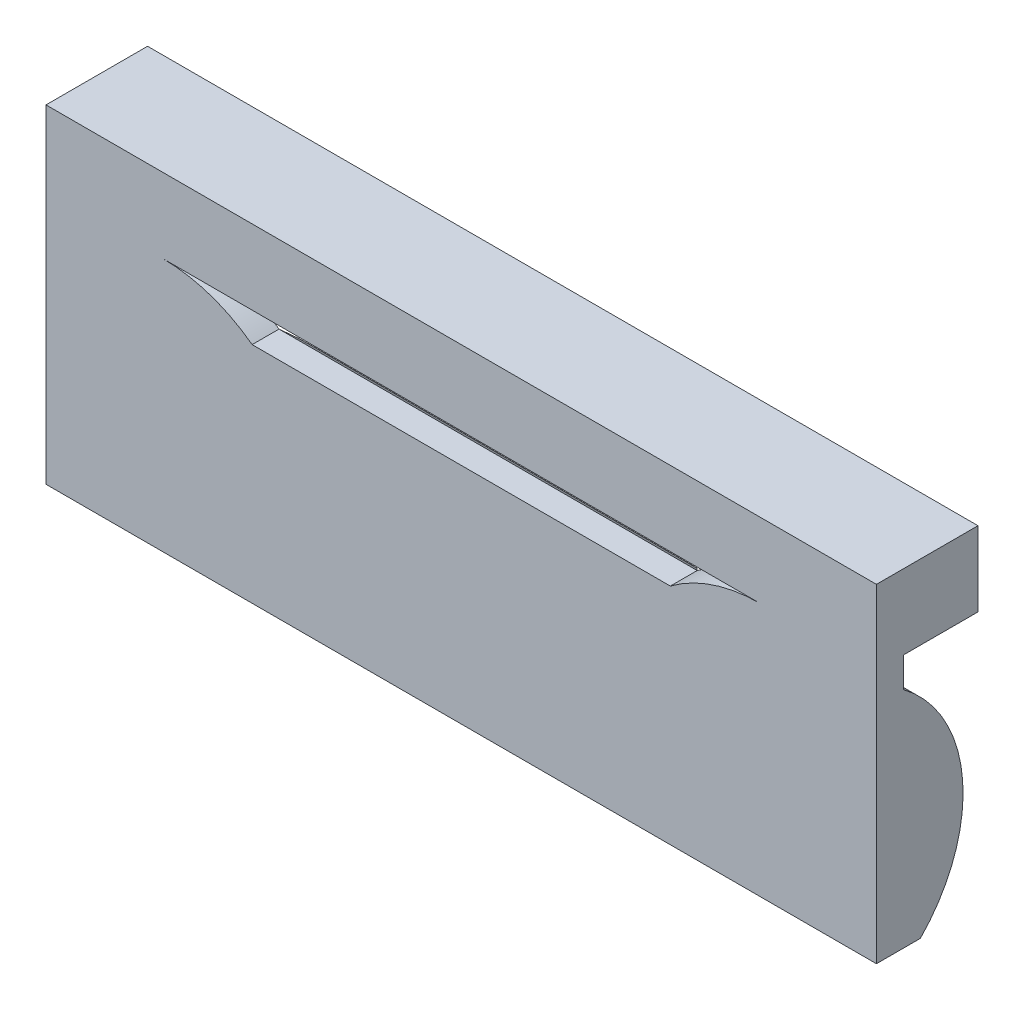
ISO-10303-21;
HEADER;
FILE_DESCRIPTION(('STEP AP214'),'2;1');
FILE_NAME('part.step','',(''),(''),'','','');
FILE_SCHEMA(('AUTOMOTIVE_DESIGN { 1 0 10303 214 1 1 1 1 }'));
ENDSEC;
DATA;
#1=APPLICATION_CONTEXT('core data for automotive mechanical design processes');
#2=APPLICATION_PROTOCOL_DEFINITION('international standard','automotive_design',2000,#1);
#3=PRODUCT_CONTEXT('',#1,'mechanical');
#4=PRODUCT('Part','Part','',(#3));
#5=PRODUCT_RELATED_PRODUCT_CATEGORY('part','',(#4));
#6=PRODUCT_DEFINITION_FORMATION('','',#4);
#7=PRODUCT_DEFINITION_CONTEXT('part definition',#1,'design');
#8=PRODUCT_DEFINITION('design','',#6,#7);
#9=PRODUCT_DEFINITION_SHAPE('','',#8);
#10=(LENGTH_UNIT() NAMED_UNIT(*) SI_UNIT(.MILLI.,.METRE.));
#11=(NAMED_UNIT(*) PLANE_ANGLE_UNIT() SI_UNIT($,.RADIAN.));
#12=(NAMED_UNIT(*) SI_UNIT($,.STERADIAN.) SOLID_ANGLE_UNIT());
#13=UNCERTAINTY_MEASURE_WITH_UNIT(LENGTH_MEASURE(1.E-05),#10,'distance_accuracy_value','');
#14=(GEOMETRIC_REPRESENTATION_CONTEXT(3) GLOBAL_UNCERTAINTY_ASSIGNED_CONTEXT((#13)) GLOBAL_UNIT_ASSIGNED_CONTEXT((#10,
#11,#12)) REPRESENTATION_CONTEXT('',''));
#15=CARTESIAN_POINT('',(0.,0.,0.));
#16=DIRECTION('',(0.,0.,1.));
#17=DIRECTION('',(1.,0.,0.));
#18=AXIS2_PLACEMENT_3D('',#15,#16,#17);
#19=CARTESIAN_POINT('',(6.5,0.,-1.475));
#20=DIRECTION('',(-1.,0.,0.));
#21=DIRECTION('',(0.,0.,1.));
#22=AXIS2_PLACEMENT_3D('',#19,#20,#21);
#23=PLANE('',#22);
#24=CARTESIAN_POINT('',(6.5,-0.999999999999999,1.275));
#25=DIRECTION('',(-1.,0.,0.));
#26=DIRECTION('',(0.,0.,1.));
#27=AXIS2_PLACEMENT_3D('',#24,#25,#26);
#28=CIRCLE('',#27,2.5);
#29=CARTESIAN_POINT('',(6.5,-2.25,-0.890063509461097));
#30=VERTEX_POINT('',#29);
#31=CARTESIAN_POINT('',(6.5,1.,-0.225));
#32=VERTEX_POINT('',#31);
#33=EDGE_CURVE('E191',#30,#32,#28,.F.);
#34=ORIENTED_EDGE('',*,*,#33,.F.);
#35=DIRECTION('',(0.,0.,1.));
#36=VECTOR('',#35,1.);
#37=CARTESIAN_POINT('',(6.5,-2.25,-1.475));
#38=LINE('',#37,#36);
#39=CARTESIAN_POINT('',(6.5,-2.25,-0.225));
#40=VERTEX_POINT('',#39);
#41=EDGE_CURVE('E341',#30,#40,#38,.T.);
#42=ORIENTED_EDGE('',*,*,#41,.T.);
#43=DIRECTION('',(0.,-1.,0.));
#44=VECTOR('',#43,1.);
#45=CARTESIAN_POINT('',(6.5,0.,-0.225));
#46=LINE('',#45,#44);
#47=EDGE_CURVE('E317',#32,#40,#46,.T.);
#48=ORIENTED_EDGE('',*,*,#47,.F.);
#49=EDGE_LOOP('',(#34,#42,#48));
#50=FACE_BOUND('',#49,.T.);
#51=ADVANCED_FACE('F43',(#50),#23,.T.);
#52=CARTESIAN_POINT('',(-6.5,0.,-1.475));
#53=DIRECTION('',(1.,0.,0.));
#54=DIRECTION('',(0.,1.,0.));
#55=AXIS2_PLACEMENT_3D('',#52,#53,#54);
#56=PLANE('',#55);
#57=CARTESIAN_POINT('',(-6.5,-0.999999999999999,1.275));
#58=DIRECTION('',(1.,0.,0.));
#59=DIRECTION('',(0.,1.,0.));
#60=AXIS2_PLACEMENT_3D('',#57,#58,#59);
#61=CIRCLE('',#60,2.5);
#62=CARTESIAN_POINT('',(-6.5,1.,-0.225));
#63=VERTEX_POINT('',#62);
#64=CARTESIAN_POINT('',(-6.5,-2.25,-0.890063509461097));
#65=VERTEX_POINT('',#64);
#66=EDGE_CURVE('E248',#63,#65,#61,.F.);
#67=ORIENTED_EDGE('',*,*,#66,.F.);
#68=DIRECTION('',(0.,1.,0.));
#69=VECTOR('',#68,1.);
#70=CARTESIAN_POINT('',(-6.5,0.,-0.225));
#71=LINE('',#70,#69);
#72=CARTESIAN_POINT('',(-6.5,-2.25,-0.225));
#73=VERTEX_POINT('',#72);
#74=EDGE_CURVE('E350',#73,#63,#71,.T.);
#75=ORIENTED_EDGE('',*,*,#74,.F.);
#76=DIRECTION('',(0.,0.,1.));
#77=VECTOR('',#76,1.);
#78=CARTESIAN_POINT('',(-6.5,-2.25,-1.475));
#79=LINE('',#78,#77);
#80=EDGE_CURVE('E67',#65,#73,#79,.T.);
#81=ORIENTED_EDGE('',*,*,#80,.F.);
#82=EDGE_LOOP('',(#67,#75,#81));
#83=FACE_BOUND('',#82,.T.);
#84=ADVANCED_FACE('F451',(#83),#56,.T.);
#85=CARTESIAN_POINT('',(0.,0.,-1.475));
#86=DIRECTION('',(0.,0.,-1.));
#87=DIRECTION('',(-1.,0.,0.));
#88=AXIS2_PLACEMENT_3D('',#85,#86,#87);
#89=PLANE('',#88);
#90=DIRECTION('',(0.,-1.,0.));
#91=VECTOR('',#90,1.);
#92=CARTESIAN_POINT('',(6.95,0.,-1.475));
#93=LINE('',#92,#91);
#94=CARTESIAN_POINT('',(6.95,2.75,-1.475));
#95=VERTEX_POINT('',#94);
#96=CARTESIAN_POINT('',(6.95,1.5,-1.475));
#97=VERTEX_POINT('',#96);
#98=EDGE_CURVE('E334',#95,#97,#93,.T.);
#99=ORIENTED_EDGE('',*,*,#98,.T.);
#100=DIRECTION('',(-1.,0.,0.));
#101=VECTOR('',#100,1.);
#102=CARTESIAN_POINT('',(0.,1.5,-1.475));
#103=LINE('',#102,#101);
#104=CARTESIAN_POINT('',(6.5,1.5,-1.475));
#105=VERTEX_POINT('',#104);
#106=EDGE_CURVE('E259',#97,#105,#103,.T.);
#107=ORIENTED_EDGE('',*,*,#106,.T.);
#108=DIRECTION('',(0.,-1.,0.));
#109=VECTOR('',#108,1.);
#110=CARTESIAN_POINT('',(6.5,0.,-1.475));
#111=LINE('',#110,#109);
#112=CARTESIAN_POINT('',(6.5,2.25,-1.475));
#113=VERTEX_POINT('',#112);
#114=EDGE_CURVE('E318',#113,#105,#111,.T.);
#115=ORIENTED_EDGE('',*,*,#114,.F.);
#116=DIRECTION('',(1.,0.,0.));
#117=VECTOR('',#116,1.);
#118=CARTESIAN_POINT('',(0.,2.25,-1.475));
#119=LINE('',#118,#117);
#120=CARTESIAN_POINT('',(-6.5,2.25,-1.475));
#121=VERTEX_POINT('',#120);
#122=EDGE_CURVE('E322',#121,#113,#119,.T.);
#123=ORIENTED_EDGE('',*,*,#122,.F.);
#124=DIRECTION('',(0.,1.,0.));
#125=VECTOR('',#124,1.);
#126=CARTESIAN_POINT('',(-6.5,0.,-1.475));
#127=LINE('',#126,#125);
#128=CARTESIAN_POINT('',(-6.5,1.5,-1.475));
#129=VERTEX_POINT('',#128);
#130=EDGE_CURVE('E327',#129,#121,#127,.T.);
#131=ORIENTED_EDGE('',*,*,#130,.F.);
#132=CARTESIAN_POINT('',(-6.95,1.5,-1.475));
#133=VERTEX_POINT('',#132);
#134=EDGE_CURVE('E254',#129,#133,#103,.T.);
#135=ORIENTED_EDGE('',*,*,#134,.T.);
#136=DIRECTION('',(0.,1.,0.));
#137=VECTOR('',#136,1.);
#138=CARTESIAN_POINT('',(-6.95,0.,-1.475));
#139=LINE('',#138,#137);
#140=CARTESIAN_POINT('',(-6.95,2.74999999999995,-1.475));
#141=VERTEX_POINT('',#140);
#142=EDGE_CURVE('E338',#133,#141,#139,.T.);
#143=ORIENTED_EDGE('',*,*,#142,.T.);
#144=DIRECTION('',(1.,0.,0.));
#145=VECTOR('',#144,1.);
#146=CARTESIAN_POINT('',(0.,2.74999999999997,-1.475));
#147=LINE('',#146,#145);
#148=EDGE_CURVE('E330',#141,#95,#147,.T.);
#149=ORIENTED_EDGE('',*,*,#148,.T.);
#150=EDGE_LOOP('',(#99,#107,#115,#123,#131,#135,#143,#149));
#151=FACE_BOUND('',#150,.T.);
#152=ADVANCED_FACE('F401',(#151),#89,.T.);
#153=CARTESIAN_POINT('',(0.,0.,0.225));
#154=DIRECTION('',(0.,0.,1.));
#155=DIRECTION('',(1.,0.,0.));
#156=AXIS2_PLACEMENT_3D('',#153,#154,#155);
#157=PLANE('',#156);
#158=DIRECTION('',(0.,1.,0.));
#159=VECTOR('',#158,1.);
#160=CARTESIAN_POINT('',(6.95,0.,0.225));
#161=LINE('',#160,#159);
#162=CARTESIAN_POINT('',(6.95,-2.75,0.225));
#163=VERTEX_POINT('',#162);
#164=CARTESIAN_POINT('',(6.95,2.75,0.225));
#165=VERTEX_POINT('',#164);
#166=EDGE_CURVE('E369',#163,#165,#161,.T.);
#167=ORIENTED_EDGE('',*,*,#166,.T.);
#168=DIRECTION('',(-1.,0.,0.));
#169=VECTOR('',#168,1.);
#170=CARTESIAN_POINT('',(0.,2.74999999999997,0.225));
#171=LINE('',#170,#169);
#172=CARTESIAN_POINT('',(-6.95,2.75,0.225));
#173=VERTEX_POINT('',#172);
#174=EDGE_CURVE('E373',#165,#173,#171,.T.);
#175=ORIENTED_EDGE('',*,*,#174,.T.);
#176=DIRECTION('',(0.,1.,0.));
#177=VECTOR('',#176,1.);
#178=CARTESIAN_POINT('',(-6.95,0.,0.225));
#179=LINE('',#178,#177);
#180=CARTESIAN_POINT('',(-6.95,-2.75,0.225));
#181=VERTEX_POINT('',#180);
#182=EDGE_CURVE('E376',#181,#173,#179,.T.);
#183=ORIENTED_EDGE('',*,*,#182,.F.);
#184=DIRECTION('',(1.,0.,0.));
#185=VECTOR('',#184,1.);
#186=CARTESIAN_POINT('',(0.,-2.75,0.225));
#187=LINE('',#186,#185);
#188=EDGE_CURVE('E380',#181,#163,#187,.T.);
#189=ORIENTED_EDGE('',*,*,#188,.T.);
#190=EDGE_LOOP('',(#167,#175,#183,#189));
#191=FACE_BOUND('',#190,.T.);
#192=DIRECTION('',(1.,0.,0.));
#193=VECTOR('',#192,1.);
#194=CARTESIAN_POINT('',(0.,1.50000000000001,0.225));
#195=LINE('',#194,#193);
#196=CARTESIAN_POINT('',(-5.,1.5,0.225));
#197=VERTEX_POINT('',#196);
#198=CARTESIAN_POINT('',(5.,1.50000000000002,0.225));
#199=VERTEX_POINT('',#198);
#200=EDGE_CURVE('E267',#197,#199,#195,.T.);
#201=ORIENTED_EDGE('',*,*,#200,.T.);
#202=CARTESIAN_POINT('',(5.00000000000001,-0.999999999999964,0.225));
#203=DIRECTION('',(0.,0.,-1.));
#204=DIRECTION('',(-1.,0.,0.));
#205=AXIS2_PLACEMENT_3D('',#202,#203,#204);
#206=CIRCLE('',#205,2.49999999999998);
#207=CARTESIAN_POINT('',(3.5,1.00000000000001,0.225));
#208=VERTEX_POINT('',#207);
#209=EDGE_CURVE('E271',#199,#208,#206,.F.);
#210=ORIENTED_EDGE('',*,*,#209,.T.);
#211=DIRECTION('',(-1.,0.,0.));
#212=VECTOR('',#211,1.);
#213=CARTESIAN_POINT('',(0.,1.00000000000001,0.225));
#214=LINE('',#213,#212);
#215=CARTESIAN_POINT('',(-3.5,1.,0.225));
#216=VERTEX_POINT('',#215);
#217=EDGE_CURVE('E59',#208,#216,#214,.T.);
#218=ORIENTED_EDGE('',*,*,#217,.T.);
#219=CARTESIAN_POINT('',(-5.,-0.999999999999999,0.225));
#220=DIRECTION('',(0.,0.,-1.));
#221=DIRECTION('',(-1.,0.,0.));
#222=AXIS2_PLACEMENT_3D('',#219,#220,#221);
#223=CIRCLE('',#222,2.5);
#224=EDGE_CURVE('E277',#216,#197,#223,.F.);
#225=ORIENTED_EDGE('',*,*,#224,.T.);
#226=EDGE_LOOP('',(#201,#210,#218,#225));
#227=FACE_BOUND('',#226,.T.);
#228=ADVANCED_FACE('F410',(#191,#227),#157,.T.);
#229=CARTESIAN_POINT('',(0.,-2.25,-1.475));
#230=DIRECTION('',(0.,1.,0.));
#231=DIRECTION('',(-1.,0.,0.));
#232=AXIS2_PLACEMENT_3D('',#229,#230,#231);
#233=PLANE('',#232);
#234=DIRECTION('',(1.,0.,0.));
#235=VECTOR('',#234,1.);
#236=CARTESIAN_POINT('',(-6.95,-2.25,-0.890063509461097));
#237=LINE('',#236,#235);
#238=CARTESIAN_POINT('',(-2.8349364905389,-2.25,-0.890063509461096));
#239=VERTEX_POINT('',#238);
#240=EDGE_CURVE('E245',#65,#239,#237,.T.);
#241=ORIENTED_EDGE('',*,*,#240,.F.);
#242=ORIENTED_EDGE('',*,*,#80,.T.);
#243=DIRECTION('',(-1.,0.,0.));
#244=VECTOR('',#243,1.);
#245=CARTESIAN_POINT('',(0.,-2.25,-0.225));
#246=LINE('',#245,#244);
#247=CARTESIAN_POINT('',(-2.8349364905389,-2.25,-0.225));
#248=VERTEX_POINT('',#247);
#249=EDGE_CURVE('E354',#248,#73,#246,.T.);
#250=ORIENTED_EDGE('',*,*,#249,.F.);
#251=DIRECTION('',(0.,0.,1.));
#252=VECTOR('',#251,1.);
#253=CARTESIAN_POINT('',(-2.8349364905389,-2.25,-2.225));
#254=LINE('',#253,#252);
#255=EDGE_CURVE('E311',#239,#248,#254,.T.);
#256=ORIENTED_EDGE('',*,*,#255,.F.);
#257=EDGE_LOOP('',(#241,#242,#250,#256));
#258=FACE_BOUND('',#257,.T.);
#259=ADVANCED_FACE('F476',(#258),#233,.T.);
#260=CARTESIAN_POINT('',(6.95,0.,0.225));
#261=DIRECTION('',(-1.,0.,0.));
#262=DIRECTION('',(0.,0.,1.));
#263=AXIS2_PLACEMENT_3D('',#260,#261,#262);
#264=PLANE('',#263);
#265=DIRECTION('',(0.,0.,-1.));
#266=VECTOR('',#265,1.);
#267=CARTESIAN_POINT('',(6.95,1.5,0.));
#268=LINE('',#267,#266);
#269=CARTESIAN_POINT('',(6.95,1.5,-0.225));
#270=VERTEX_POINT('',#269);
#271=EDGE_CURVE('E215',#270,#97,#268,.T.);
#272=ORIENTED_EDGE('',*,*,#271,.T.);
#273=ORIENTED_EDGE('',*,*,#98,.F.);
#274=DIRECTION('',(0.,0.,-1.));
#275=VECTOR('',#274,1.);
#276=CARTESIAN_POINT('',(6.95,2.75,0.225));
#277=LINE('',#276,#275);
#278=EDGE_CURVE('E52',#165,#95,#277,.T.);
#279=ORIENTED_EDGE('',*,*,#278,.F.);
#280=ORIENTED_EDGE('',*,*,#166,.F.);
#281=DIRECTION('',(0.,0.,-1.));
#282=VECTOR('',#281,1.);
#283=CARTESIAN_POINT('',(6.95,-2.75,0.225));
#284=LINE('',#283,#282);
#285=CARTESIAN_POINT('',(6.95,-2.75,-0.51035710713571));
#286=VERTEX_POINT('',#285);
#287=EDGE_CURVE('E213',#163,#286,#284,.T.);
#288=ORIENTED_EDGE('',*,*,#287,.T.);
#289=CARTESIAN_POINT('',(6.95,-0.999999999999999,1.275));
#290=DIRECTION('',(1.,0.,0.));
#291=DIRECTION('',(0.,0.,-1.));
#292=AXIS2_PLACEMENT_3D('',#289,#290,#291);
#293=CIRCLE('',#292,2.5);
#294=CARTESIAN_POINT('',(6.95,1.,-0.225));
#295=VERTEX_POINT('',#294);
#296=EDGE_CURVE('E188',#295,#286,#293,.F.);
#297=ORIENTED_EDGE('',*,*,#296,.F.);
#298=DIRECTION('',(0.,1.,0.));
#299=VECTOR('',#298,1.);
#300=CARTESIAN_POINT('',(6.95,0.,-0.225));
#301=LINE('',#300,#299);
#302=EDGE_CURVE('E200',#295,#270,#301,.T.);
#303=ORIENTED_EDGE('',*,*,#302,.T.);
#304=EDGE_LOOP('',(#272,#273,#279,#280,#288,#297,#303));
#305=FACE_BOUND('',#304,.T.);
#306=ADVANCED_FACE('F45',(#305),#264,.F.);
#307=CARTESIAN_POINT('',(0.,2.74999999999997,0.225));
#308=DIRECTION('',(0.,-1.,0.));
#309=DIRECTION('',(1.,0.,0.));
#310=AXIS2_PLACEMENT_3D('',#307,#308,#309);
#311=PLANE('',#310);
#312=ORIENTED_EDGE('',*,*,#278,.T.);
#313=ORIENTED_EDGE('',*,*,#148,.F.);
#314=DIRECTION('',(0.,0.,-1.));
#315=VECTOR('',#314,1.);
#316=CARTESIAN_POINT('',(-6.95,2.75,0.225));
#317=LINE('',#316,#315);
#318=EDGE_CURVE('E389',#173,#141,#317,.T.);
#319=ORIENTED_EDGE('',*,*,#318,.F.);
#320=ORIENTED_EDGE('',*,*,#174,.F.);
#321=EDGE_LOOP('',(#312,#313,#319,#320));
#322=FACE_BOUND('',#321,.T.);
#323=ADVANCED_FACE('F397',(#322),#311,.F.);
#324=CARTESIAN_POINT('',(-6.95,0.,0.225));
#325=DIRECTION('',(-1.,0.,0.));
#326=DIRECTION('',(0.,0.,1.));
#327=AXIS2_PLACEMENT_3D('',#324,#325,#326);
#328=PLANE('',#327);
#329=ORIENTED_EDGE('',*,*,#142,.F.);
#330=DIRECTION('',(0.,0.,-1.));
#331=VECTOR('',#330,1.);
#332=CARTESIAN_POINT('',(-6.95,1.5,0.));
#333=LINE('',#332,#331);
#334=CARTESIAN_POINT('',(-6.95,1.5,-0.225));
#335=VERTEX_POINT('',#334);
#336=EDGE_CURVE('E197',#335,#133,#333,.T.);
#337=ORIENTED_EDGE('',*,*,#336,.F.);
#338=DIRECTION('',(0.,1.,0.));
#339=VECTOR('',#338,1.);
#340=CARTESIAN_POINT('',(-6.95,0.,-0.225));
#341=LINE('',#340,#339);
#342=CARTESIAN_POINT('',(-6.95,1.,-0.225));
#343=VERTEX_POINT('',#342);
#344=EDGE_CURVE('E218',#343,#335,#341,.T.);
#345=ORIENTED_EDGE('',*,*,#344,.F.);
#346=CARTESIAN_POINT('',(-6.95,-0.999999999999999,1.275));
#347=DIRECTION('',(1.,0.,0.));
#348=DIRECTION('',(0.,0.,-1.));
#349=AXIS2_PLACEMENT_3D('',#346,#347,#348);
#350=CIRCLE('',#349,2.5);
#351=CARTESIAN_POINT('',(-6.95,-2.75,-0.51035710713571));
#352=VERTEX_POINT('',#351);
#353=EDGE_CURVE('E223',#343,#352,#350,.F.);
#354=ORIENTED_EDGE('',*,*,#353,.T.);
#355=DIRECTION('',(0.,0.,-1.));
#356=VECTOR('',#355,1.);
#357=CARTESIAN_POINT('',(-6.95,-2.75,0.225));
#358=LINE('',#357,#356);
#359=EDGE_CURVE('E385',#181,#352,#358,.T.);
#360=ORIENTED_EDGE('',*,*,#359,.F.);
#361=ORIENTED_EDGE('',*,*,#182,.T.);
#362=ORIENTED_EDGE('',*,*,#318,.T.);
#363=EDGE_LOOP('',(#329,#337,#345,#354,#360,#361,#362));
#364=FACE_BOUND('',#363,.T.);
#365=ADVANCED_FACE('F406',(#364),#328,.T.);
#366=CARTESIAN_POINT('',(0.,-2.75,0.225));
#367=DIRECTION('',(0.,1.,0.));
#368=DIRECTION('',(0.,0.,1.));
#369=AXIS2_PLACEMENT_3D('',#366,#367,#368);
#370=PLANE('',#369);
#371=ORIENTED_EDGE('',*,*,#359,.T.);
#372=DIRECTION('',(1.,0.,0.));
#373=VECTOR('',#372,1.);
#374=CARTESIAN_POINT('',(-6.95,-2.75,-0.51035710713571));
#375=LINE('',#374,#373);
#376=EDGE_CURVE('E251',#352,#286,#375,.T.);
#377=ORIENTED_EDGE('',*,*,#376,.T.);
#378=ORIENTED_EDGE('',*,*,#287,.F.);
#379=ORIENTED_EDGE('',*,*,#188,.F.);
#380=EDGE_LOOP('',(#371,#377,#378,#379));
#381=FACE_BOUND('',#380,.T.);
#382=ADVANCED_FACE('F413',(#381),#370,.F.);
#383=ORIENTED_EDGE('',*,*,#114,.T.);
#384=DIRECTION('',(0.,0.,1.));
#385=VECTOR('',#384,1.);
#386=CARTESIAN_POINT('',(6.5,1.5,-1.475));
#387=LINE('',#386,#385);
#388=CARTESIAN_POINT('',(6.5,1.5,-0.225));
#389=VERTEX_POINT('',#388);
#390=EDGE_CURVE('E263',#105,#389,#387,.T.);
#391=ORIENTED_EDGE('',*,*,#390,.T.);
#392=CARTESIAN_POINT('',(6.5,2.25,-0.225));
#393=VERTEX_POINT('',#392);
#394=EDGE_CURVE('E342',#393,#389,#46,.T.);
#395=ORIENTED_EDGE('',*,*,#394,.F.);
#396=DIRECTION('',(0.,0.,1.));
#397=VECTOR('',#396,1.);
#398=CARTESIAN_POINT('',(6.5,2.25,-1.475));
#399=LINE('',#398,#397);
#400=EDGE_CURVE('E366',#113,#393,#399,.T.);
#401=ORIENTED_EDGE('',*,*,#400,.F.);
#402=EDGE_LOOP('',(#383,#391,#395,#401));
#403=FACE_BOUND('',#402,.T.);
#404=ADVANCED_FACE('F437',(#403),#23,.T.);
#405=CARTESIAN_POINT('',(0.,2.25,-1.475));
#406=DIRECTION('',(0.,-1.,0.));
#407=DIRECTION('',(1.,0.,0.));
#408=AXIS2_PLACEMENT_3D('',#405,#406,#407);
#409=PLANE('',#408);
#410=DIRECTION('',(1.,0.,0.));
#411=VECTOR('',#410,1.);
#412=CARTESIAN_POINT('',(0.,2.25,-0.225));
#413=LINE('',#412,#411);
#414=CARTESIAN_POINT('',(-6.5,2.25,-0.225));
#415=VERTEX_POINT('',#414);
#416=EDGE_CURVE('E345',#415,#393,#413,.T.);
#417=ORIENTED_EDGE('',*,*,#416,.F.);
#418=DIRECTION('',(0.,0.,1.));
#419=VECTOR('',#418,1.);
#420=CARTESIAN_POINT('',(-6.5,2.25,-1.475));
#421=LINE('',#420,#419);
#422=EDGE_CURVE('E362',#121,#415,#421,.T.);
#423=ORIENTED_EDGE('',*,*,#422,.F.);
#424=ORIENTED_EDGE('',*,*,#122,.T.);
#425=ORIENTED_EDGE('',*,*,#400,.T.);
#426=EDGE_LOOP('',(#417,#423,#424,#425));
#427=FACE_BOUND('',#426,.T.);
#428=ADVANCED_FACE('F426',(#427),#409,.T.);
#429=CARTESIAN_POINT('',(-6.5,1.5,-0.225));
#430=VERTEX_POINT('',#429);
#431=EDGE_CURVE('E349',#430,#415,#71,.T.);
#432=ORIENTED_EDGE('',*,*,#431,.F.);
#433=DIRECTION('',(0.,0.,-1.));
#434=VECTOR('',#433,1.);
#435=CARTESIAN_POINT('',(-6.5,1.5,-1.475));
#436=LINE('',#435,#434);
#437=EDGE_CURVE('E258',#430,#129,#436,.T.);
#438=ORIENTED_EDGE('',*,*,#437,.T.);
#439=ORIENTED_EDGE('',*,*,#130,.T.);
#440=ORIENTED_EDGE('',*,*,#422,.T.);
#441=EDGE_LOOP('',(#432,#438,#439,#440));
#442=FACE_BOUND('',#441,.T.);
#443=ADVANCED_FACE('F420',(#442),#56,.T.);
#444=DIRECTION('',(1.,0.,0.));
#445=VECTOR('',#444,1.);
#446=CARTESIAN_POINT('',(-6.95,-2.25,-0.890063509461097));
#447=LINE('',#446,#445);
#448=CARTESIAN_POINT('',(2.83493649053895,-2.25,-0.890063509461059));
#449=VERTEX_POINT('',#448);
#450=EDGE_CURVE('E237',#449,#30,#447,.T.);
#451=ORIENTED_EDGE('',*,*,#450,.F.);
#452=DIRECTION('',(0.,0.,1.));
#453=VECTOR('',#452,1.);
#454=CARTESIAN_POINT('',(2.83493649053895,-2.25,-2.225));
#455=LINE('',#454,#453);
#456=CARTESIAN_POINT('',(2.83493649053895,-2.25,-0.225));
#457=VERTEX_POINT('',#456);
#458=EDGE_CURVE('E314',#449,#457,#455,.T.);
#459=ORIENTED_EDGE('',*,*,#458,.T.);
#460=EDGE_CURVE('E323',#40,#457,#246,.T.);
#461=ORIENTED_EDGE('',*,*,#460,.F.);
#462=ORIENTED_EDGE('',*,*,#41,.F.);
#463=EDGE_LOOP('',(#451,#459,#461,#462));
#464=FACE_BOUND('',#463,.T.);
#465=ADVANCED_FACE('F481',(#464),#233,.T.);
#466=CARTESIAN_POINT('',(0.,0.,-0.225));
#467=DIRECTION('',(0.,0.,1.));
#468=DIRECTION('',(1.,0.,0.));
#469=AXIS2_PLACEMENT_3D('',#466,#467,#468);
#470=PLANE('',#469);
#471=CARTESIAN_POINT('',(5.00000000000001,-0.999999999999964,-0.225));
#472=DIRECTION('',(0.,0.,-1.));
#473=DIRECTION('',(-1.,0.,0.));
#474=AXIS2_PLACEMENT_3D('',#471,#472,#473);
#475=CIRCLE('',#474,2.49999999999998);
#476=CARTESIAN_POINT('',(3.5,1.,-0.225));
#477=VERTEX_POINT('',#476);
#478=EDGE_CURVE('E308',#457,#477,#475,.T.);
#479=ORIENTED_EDGE('',*,*,#478,.T.);
#480=CARTESIAN_POINT('',(5.00000000000001,-0.999999999999964,-0.225));
#481=DIRECTION('',(0.,0.,1.));
#482=DIRECTION('',(1.,0.,0.));
#483=AXIS2_PLACEMENT_3D('',#480,#481,#482);
#484=CIRCLE('',#483,2.49999999999998);
#485=CARTESIAN_POINT('',(5.,1.50000000000002,-0.225));
#486=VERTEX_POINT('',#485);
#487=EDGE_CURVE('E286',#477,#486,#484,.F.);
#488=ORIENTED_EDGE('',*,*,#487,.T.);
#489=DIRECTION('',(1.,0.,0.));
#490=VECTOR('',#489,1.);
#491=CARTESIAN_POINT('',(0.,1.50000000000001,-0.225));
#492=LINE('',#491,#490);
#493=CARTESIAN_POINT('',(-5.,1.5,-0.225));
#494=VERTEX_POINT('',#493);
#495=EDGE_CURVE('E305',#494,#486,#492,.T.);
#496=ORIENTED_EDGE('',*,*,#495,.F.);
#497=CARTESIAN_POINT('',(-5.,-0.999999999999999,-0.225));
#498=DIRECTION('',(0.,0.,-1.));
#499=DIRECTION('',(-1.,0.,0.));
#500=AXIS2_PLACEMENT_3D('',#497,#498,#499);
#501=CIRCLE('',#500,2.5);
#502=CARTESIAN_POINT('',(-3.5,1.,-0.225));
#503=VERTEX_POINT('',#502);
#504=EDGE_CURVE('E301',#494,#503,#501,.T.);
#505=ORIENTED_EDGE('',*,*,#504,.T.);
#506=EDGE_CURVE('E300',#503,#248,#501,.T.);
#507=ORIENTED_EDGE('',*,*,#506,.T.);
#508=ORIENTED_EDGE('',*,*,#249,.T.);
#509=ORIENTED_EDGE('',*,*,#74,.T.);
#510=DIRECTION('',(1.,0.,0.));
#511=VECTOR('',#510,1.);
#512=CARTESIAN_POINT('',(-6.95,1.,-0.225));
#513=LINE('',#512,#511);
#514=EDGE_CURVE('E196',#343,#63,#513,.T.);
#515=ORIENTED_EDGE('',*,*,#514,.F.);
#516=ORIENTED_EDGE('',*,*,#344,.T.);
#517=DIRECTION('',(1.,0.,0.));
#518=VECTOR('',#517,1.);
#519=CARTESIAN_POINT('',(-6.95,1.5,-0.225));
#520=LINE('',#519,#518);
#521=EDGE_CURVE('E229',#335,#430,#520,.T.);
#522=ORIENTED_EDGE('',*,*,#521,.T.);
#523=ORIENTED_EDGE('',*,*,#431,.T.);
#524=ORIENTED_EDGE('',*,*,#416,.T.);
#525=ORIENTED_EDGE('',*,*,#394,.T.);
#526=EDGE_CURVE('E204',#389,#270,#520,.T.);
#527=ORIENTED_EDGE('',*,*,#526,.T.);
#528=ORIENTED_EDGE('',*,*,#302,.F.);
#529=EDGE_CURVE('E183',#32,#295,#513,.T.);
#530=ORIENTED_EDGE('',*,*,#529,.F.);
#531=ORIENTED_EDGE('',*,*,#47,.T.);
#532=ORIENTED_EDGE('',*,*,#460,.T.);
#533=EDGE_LOOP('',(#479,#488,#496,#505,#507,#508,#509,#515,#516,#522,#523,#524,#525,#527,#528,
#530,#531,#532));
#534=FACE_BOUND('',#533,.T.);
#535=ADVANCED_FACE('F202',(#534),#470,.F.);
#536=CARTESIAN_POINT('',(-5.,-0.999999999999999,-2.225));
#537=DIRECTION('',(0.,0.,1.));
#538=DIRECTION('',(1.,0.,0.));
#539=AXIS2_PLACEMENT_3D('',#536,#537,#538);
#540=CYLINDRICAL_SURFACE('',#539,2.5);
#541=CARTESIAN_POINT('',(-5.,-0.999999999999999,1.275));
#542=DIRECTION('',(0.707106781186547,0.,0.707106781186547));
#543=DIRECTION('',(-0.707106781186547,0.,0.707106781186547));
#544=AXIS2_PLACEMENT_3D('',#541,#542,#543);
#545=ELLIPSE('',#544,3.53553390593274,2.5);
#546=EDGE_CURVE('E242',#239,#503,#545,.T.);
#547=ORIENTED_EDGE('',*,*,#546,.F.);
#548=ORIENTED_EDGE('',*,*,#255,.T.);
#549=ORIENTED_EDGE('',*,*,#506,.F.);
#550=EDGE_LOOP('',(#547,#548,#549));
#551=FACE_BOUND('',#550,.T.);
#552=ADVANCED_FACE('F492',(#551),#540,.F.);
#553=CARTESIAN_POINT('',(5.00000000000001,-0.999999999999964,-2.225));
#554=DIRECTION('',(0.,0.,1.));
#555=DIRECTION('',(1.,0.,0.));
#556=AXIS2_PLACEMENT_3D('',#553,#554,#555);
#557=CYLINDRICAL_SURFACE('',#556,2.49999999999998);
#558=CARTESIAN_POINT('',(5.00000000000001,-0.999999999999982,1.275));
#559=DIRECTION('',(-0.707106781186547,0.,0.707106781186547));
#560=DIRECTION('',(0.707106781186547,0.,0.707106781186547));
#561=AXIS2_PLACEMENT_3D('',#558,#559,#560);
#562=ELLIPSE('',#561,3.53553390593273,2.49999999999999);
#563=EDGE_CURVE('E232',#477,#449,#562,.T.);
#564=ORIENTED_EDGE('',*,*,#563,.F.);
#565=ORIENTED_EDGE('',*,*,#478,.F.);
#566=ORIENTED_EDGE('',*,*,#458,.F.);
#567=EDGE_LOOP('',(#564,#565,#566));
#568=FACE_BOUND('',#567,.T.);
#569=ADVANCED_FACE('F500',(#568),#557,.F.);
#570=CARTESIAN_POINT('',(0.,1.50000000000001,0.225));
#571=DIRECTION('',(0.,1.,0.));
#572=DIRECTION('',(-1.,0.,0.));
#573=AXIS2_PLACEMENT_3D('',#570,#571,#572);
#574=PLANE('',#573);
#575=DIRECTION('',(0.,0.,-1.));
#576=VECTOR('',#575,1.);
#577=CARTESIAN_POINT('',(5.,1.50000000000002,0.225));
#578=LINE('',#577,#576);
#579=EDGE_CURVE('E281',#199,#486,#578,.T.);
#580=ORIENTED_EDGE('',*,*,#579,.F.);
#581=ORIENTED_EDGE('',*,*,#200,.F.);
#582=DIRECTION('',(0.,0.,-1.));
#583=VECTOR('',#582,1.);
#584=CARTESIAN_POINT('',(-5.,1.5,0.225));
#585=LINE('',#584,#583);
#586=EDGE_CURVE('E282',#197,#494,#585,.T.);
#587=ORIENTED_EDGE('',*,*,#586,.T.);
#588=ORIENTED_EDGE('',*,*,#495,.T.);
#589=EDGE_LOOP('',(#580,#581,#587,#588));
#590=FACE_BOUND('',#589,.T.);
#591=ADVANCED_FACE('F519',(#590),#574,.F.);
#592=CARTESIAN_POINT('',(-5.,-0.999999999999999,0.225));
#593=DIRECTION('',(0.,0.,-1.));
#594=DIRECTION('',(-1.,0.,0.));
#595=AXIS2_PLACEMENT_3D('',#592,#593,#594);
#596=CYLINDRICAL_SURFACE('',#595,2.5);
#597=ORIENTED_EDGE('',*,*,#586,.F.);
#598=ORIENTED_EDGE('',*,*,#224,.F.);
#599=DIRECTION('',(0.,0.,-1.));
#600=VECTOR('',#599,1.);
#601=CARTESIAN_POINT('',(-3.5,1.,0.225));
#602=LINE('',#601,#600);
#603=EDGE_CURVE('E287',#216,#503,#602,.T.);
#604=ORIENTED_EDGE('',*,*,#603,.T.);
#605=ORIENTED_EDGE('',*,*,#504,.F.);
#606=EDGE_LOOP('',(#597,#598,#604,#605));
#607=FACE_BOUND('',#606,.T.);
#608=ADVANCED_FACE('F508',(#607),#596,.T.);
#609=CARTESIAN_POINT('',(5.00000000000001,-0.999999999999964,0.225));
#610=DIRECTION('',(0.,0.,-1.));
#611=DIRECTION('',(-1.,0.,0.));
#612=AXIS2_PLACEMENT_3D('',#609,#610,#611);
#613=CYLINDRICAL_SURFACE('',#612,2.49999999999998);
#614=DIRECTION('',(0.,0.,-1.));
#615=VECTOR('',#614,1.);
#616=CARTESIAN_POINT('',(3.5,1.00000000000001,0.225));
#617=LINE('',#616,#615);
#618=EDGE_CURVE('E291',#208,#477,#617,.T.);
#619=ORIENTED_EDGE('',*,*,#618,.F.);
#620=ORIENTED_EDGE('',*,*,#209,.F.);
#621=ORIENTED_EDGE('',*,*,#579,.T.);
#622=ORIENTED_EDGE('',*,*,#487,.F.);
#623=EDGE_LOOP('',(#619,#620,#621,#622));
#624=FACE_BOUND('',#623,.T.);
#625=ADVANCED_FACE('F447',(#624),#613,.T.);
#626=CARTESIAN_POINT('',(0.,1.00000000000001,0.225));
#627=DIRECTION('',(0.,-1.,0.));
#628=DIRECTION('',(1.,0.,0.));
#629=AXIS2_PLACEMENT_3D('',#626,#627,#628);
#630=PLANE('',#629);
#631=ORIENTED_EDGE('',*,*,#618,.T.);
#632=DIRECTION('',(1.,0.,0.));
#633=VECTOR('',#632,1.);
#634=CARTESIAN_POINT('',(-6.95,0.999999999999996,-0.225000000000008));
#635=LINE('',#634,#633);
#636=EDGE_CURVE('E11',#477,#503,#635,.F.);
#637=ORIENTED_EDGE('',*,*,#636,.T.);
#638=ORIENTED_EDGE('',*,*,#603,.F.);
#639=ORIENTED_EDGE('',*,*,#217,.F.);
#640=EDGE_LOOP('',(#631,#637,#638,#639));
#641=FACE_BOUND('',#640,.T.);
#642=ADVANCED_FACE('F440',(#641),#630,.F.);
#643=CARTESIAN_POINT('',(-6.95,1.5,0.));
#644=DIRECTION('',(0.,-1.,0.));
#645=DIRECTION('',(0.,0.,-1.));
#646=AXIS2_PLACEMENT_3D('',#643,#644,#645);
#647=PLANE('',#646);
#648=ORIENTED_EDGE('',*,*,#106,.F.);
#649=ORIENTED_EDGE('',*,*,#271,.F.);
#650=ORIENTED_EDGE('',*,*,#526,.F.);
#651=ORIENTED_EDGE('',*,*,#390,.F.);
#652=EDGE_LOOP('',(#648,#649,#650,#651));
#653=FACE_BOUND('',#652,.T.);
#654=ADVANCED_FACE('F438',(#653),#647,.T.);
#655=CARTESIAN_POINT('',(-6.95,-0.999999999999999,1.275));
#656=DIRECTION('',(1.,0.,0.));
#657=DIRECTION('',(0.,0.,-1.));
#658=AXIS2_PLACEMENT_3D('',#655,#656,#657);
#659=CYLINDRICAL_SURFACE('',#658,2.5);
#660=ORIENTED_EDGE('',*,*,#353,.F.);
#661=ORIENTED_EDGE('',*,*,#514,.T.);
#662=ORIENTED_EDGE('',*,*,#66,.T.);
#663=ORIENTED_EDGE('',*,*,#240,.T.);
#664=ORIENTED_EDGE('',*,*,#546,.T.);
#665=ORIENTED_EDGE('',*,*,#636,.F.);
#666=ORIENTED_EDGE('',*,*,#563,.T.);
#667=ORIENTED_EDGE('',*,*,#450,.T.);
#668=ORIENTED_EDGE('',*,*,#33,.T.);
#669=ORIENTED_EDGE('',*,*,#529,.T.);
#670=ORIENTED_EDGE('',*,*,#296,.T.);
#671=ORIENTED_EDGE('',*,*,#376,.F.);
#672=EDGE_LOOP('',(#660,#661,#662,#663,#664,#665,#666,#667,#668,#669,#670,#671));
#673=FACE_BOUND('',#672,.T.);
#674=ADVANCED_FACE('F186',(#673),#659,.T.);
#675=ORIENTED_EDGE('',*,*,#521,.F.);
#676=ORIENTED_EDGE('',*,*,#336,.T.);
#677=ORIENTED_EDGE('',*,*,#134,.F.);
#678=ORIENTED_EDGE('',*,*,#437,.F.);
#679=EDGE_LOOP('',(#675,#676,#677,#678));
#680=FACE_BOUND('',#679,.T.);
#681=ADVANCED_FACE('F418',(#680),#647,.T.);
#682=CLOSED_SHELL('',(#51,#84,#152,#228,#259,#306,#323,#365,#382,#404,#428,#443,#465,#535,#552,
#569,#591,#608,#625,#642,#654,#674,#681));
#683=MANIFOLD_SOLID_BREP('B2',#682);
#684=ADVANCED_BREP_SHAPE_REPRESENTATION('',(#18,#683),#14);
#685=SHAPE_DEFINITION_REPRESENTATION(#9,#684);
ENDSEC;
END-ISO-10303-21;
